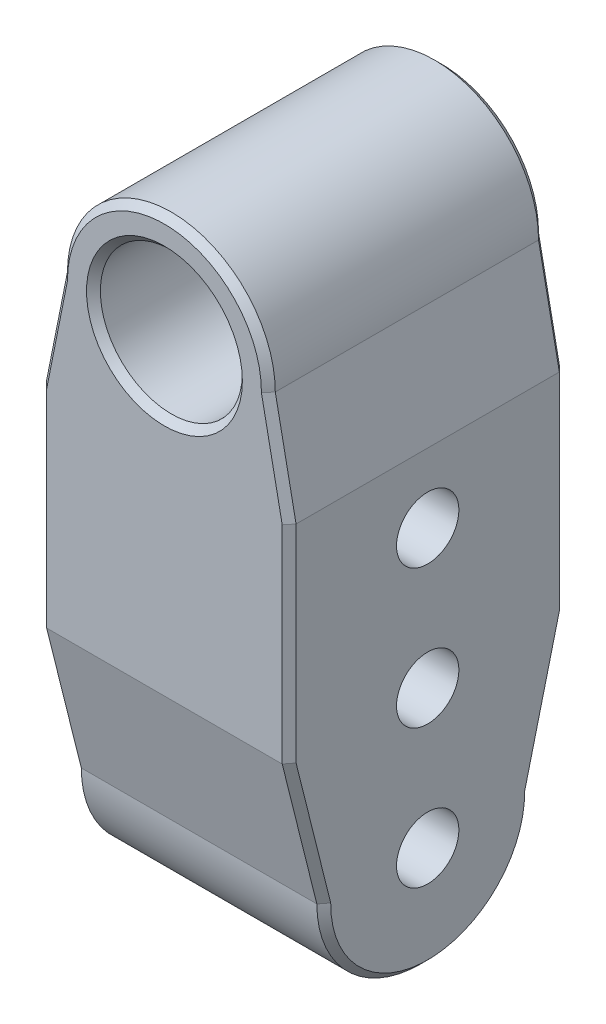
ISO-10303-21;
HEADER;
FILE_DESCRIPTION(('STEP AP214'),'2;1');
FILE_NAME('part.step','',(''),(''),'','','');
FILE_SCHEMA(('AUTOMOTIVE_DESIGN { 1 0 10303 214 1 1 1 1 }'));
ENDSEC;
DATA;
#1=APPLICATION_CONTEXT('core data for automotive mechanical design processes');
#2=APPLICATION_PROTOCOL_DEFINITION('international standard','automotive_design',2000,#1);
#3=PRODUCT_CONTEXT('',#1,'mechanical');
#4=PRODUCT('Part','Part','',(#3));
#5=PRODUCT_RELATED_PRODUCT_CATEGORY('part','',(#4));
#6=PRODUCT_DEFINITION_FORMATION('','',#4);
#7=PRODUCT_DEFINITION_CONTEXT('part definition',#1,'design');
#8=PRODUCT_DEFINITION('design','',#6,#7);
#9=PRODUCT_DEFINITION_SHAPE('','',#8);
#10=(LENGTH_UNIT() NAMED_UNIT(*) SI_UNIT(.MILLI.,.METRE.));
#11=(NAMED_UNIT(*) PLANE_ANGLE_UNIT() SI_UNIT($,.RADIAN.));
#12=(NAMED_UNIT(*) SI_UNIT($,.STERADIAN.) SOLID_ANGLE_UNIT());
#13=UNCERTAINTY_MEASURE_WITH_UNIT(LENGTH_MEASURE(1.E-05),#10,'distance_accuracy_value','');
#14=(GEOMETRIC_REPRESENTATION_CONTEXT(3) GLOBAL_UNCERTAINTY_ASSIGNED_CONTEXT((#13)) GLOBAL_UNIT_ASSIGNED_CONTEXT((#10,
#11,#12)) REPRESENTATION_CONTEXT('',''));
#15=CARTESIAN_POINT('',(0.,0.,0.));
#16=DIRECTION('',(0.,0.,1.));
#17=DIRECTION('',(1.,0.,0.));
#18=AXIS2_PLACEMENT_3D('',#15,#16,#17);
#19=CARTESIAN_POINT('',(18.,-80.,20.));
#20=DIRECTION('',(-1.,0.,0.));
#21=DIRECTION('',(0.,-1.,0.));
#22=AXIS2_PLACEMENT_3D('',#19,#20,#21);
#23=PLANE('',#22);
#24=CARTESIAN_POINT('',(18.,-25.,0.));
#25=DIRECTION('',(-1.,0.,0.));
#26=DIRECTION('',(0.,-1.,0.));
#27=AXIS2_PLACEMENT_3D('',#24,#25,#26);
#28=CIRCLE('',#27,4.5);
#29=CARTESIAN_POINT('',(18.,-29.5,0.));
#30=VERTEX_POINT('',#29);
#31=EDGE_CURVE('E394',#30,#30,#28,.T.);
#32=ORIENTED_EDGE('',*,*,#31,.T.);
#33=EDGE_LOOP('',(#32));
#34=FACE_BOUND('',#33,.T.);
#35=CARTESIAN_POINT('',(18.,-45.,0.));
#36=DIRECTION('',(-1.,0.,0.));
#37=DIRECTION('',(0.,-1.,0.));
#38=AXIS2_PLACEMENT_3D('',#35,#36,#37);
#39=CIRCLE('',#38,4.5);
#40=CARTESIAN_POINT('',(18.,-49.5,0.));
#41=VERTEX_POINT('',#40);
#42=EDGE_CURVE('E391',#41,#41,#39,.T.);
#43=ORIENTED_EDGE('',*,*,#42,.T.);
#44=EDGE_LOOP('',(#43));
#45=FACE_BOUND('',#44,.T.);
#46=CARTESIAN_POINT('',(18.,-65.,0.));
#47=DIRECTION('',(-1.,0.,0.));
#48=DIRECTION('',(0.,-1.,0.));
#49=AXIS2_PLACEMENT_3D('',#46,#47,#48);
#50=CIRCLE('',#49,4.5);
#51=CARTESIAN_POINT('',(18.,-69.5,0.));
#52=VERTEX_POINT('',#51);
#53=EDGE_CURVE('E386',#52,#52,#50,.T.);
#54=ORIENTED_EDGE('',*,*,#53,.T.);
#55=EDGE_LOOP('',(#54));
#56=FACE_BOUND('',#55,.T.);
#57=DIRECTION('',(0.,0.970142500145332,-0.242535625036333));
#58=VECTOR('',#57,1.);
#59=CARTESIAN_POINT('',(18.,-44.7574643749637,-19.0298574998547));
#60=LINE('',#59,#58);
#61=CARTESIAN_POINT('',(18.,-64.8789864532462,-13.999476980284));
#62=VERTEX_POINT('',#61);
#63=CARTESIAN_POINT('',(18.,-44.8768943743823,-19.));
#64=VERTEX_POINT('',#63);
#65=EDGE_CURVE('E50',#62,#64,#60,.T.);
#66=ORIENTED_EDGE('',*,*,#65,.T.);
#67=DIRECTION('',(0.,1.,0.));
#68=VECTOR('',#67,1.);
#69=CARTESIAN_POINT('',(18.,-80.,-19.));
#70=LINE('',#69,#68);
#71=CARTESIAN_POINT('',(18.,-15.,-19.));
#72=VERTEX_POINT('',#71);
#73=EDGE_CURVE('E11',#64,#72,#70,.T.);
#74=ORIENTED_EDGE('',*,*,#73,.T.);
#75=DIRECTION('',(0.,0.,-1.));
#76=VECTOR('',#75,1.);
#77=CARTESIAN_POINT('',(18.,-15.,20.));
#78=LINE('',#77,#76);
#79=CARTESIAN_POINT('',(18.,-15.,19.));
#80=VERTEX_POINT('',#79);
#81=EDGE_CURVE('E163',#80,#72,#78,.T.);
#82=ORIENTED_EDGE('',*,*,#81,.F.);
#83=DIRECTION('',(0.,-1.,0.));
#84=VECTOR('',#83,1.);
#85=CARTESIAN_POINT('',(18.,-45.,19.));
#86=LINE('',#85,#84);
#87=CARTESIAN_POINT('',(18.,-44.8768943743823,19.));
#88=VERTEX_POINT('',#87);
#89=EDGE_CURVE('E201',#80,#88,#86,.T.);
#90=ORIENTED_EDGE('',*,*,#89,.T.);
#91=DIRECTION('',(0.,-0.970142500145332,-0.242535625036333));
#92=VECTOR('',#91,1.);
#93=CARTESIAN_POINT('',(18.,-64.7574643749637,14.0298574998547));
#94=LINE('',#93,#92);
#95=CARTESIAN_POINT('',(18.,-64.8789864532462,13.9994769802841));
#96=VERTEX_POINT('',#95);
#97=EDGE_CURVE('E203',#88,#96,#94,.T.);
#98=ORIENTED_EDGE('',*,*,#97,.T.);
#99=CARTESIAN_POINT('',(18.,-65.,0.));
#100=DIRECTION('',(-1.,0.,0.));
#101=DIRECTION('',(0.,-1.,0.));
#102=AXIS2_PLACEMENT_3D('',#99,#100,#101);
#103=CIRCLE('',#102,14.);
#104=EDGE_CURVE('E61',#96,#62,#103,.F.);
#105=ORIENTED_EDGE('',*,*,#104,.T.);
#106=EDGE_LOOP('',(#66,#74,#82,#90,#98,#105));
#107=FACE_BOUND('',#106,.T.);
#108=ADVANCED_FACE('F40',(#34,#45,#56,#107),#23,.F.);
#109=CARTESIAN_POINT('',(-18.,-80.,20.));
#110=DIRECTION('',(1.,0.,0.));
#111=DIRECTION('',(0.,1.,0.));
#112=AXIS2_PLACEMENT_3D('',#109,#110,#111);
#113=PLANE('',#112);
#114=CARTESIAN_POINT('',(-18.,-25.,0.));
#115=DIRECTION('',(1.,0.,0.));
#116=DIRECTION('',(0.,1.,0.));
#117=AXIS2_PLACEMENT_3D('',#114,#115,#116);
#118=CIRCLE('',#117,4.5);
#119=CARTESIAN_POINT('',(-18.,-20.5,0.));
#120=VERTEX_POINT('',#119);
#121=EDGE_CURVE('E392',#120,#120,#118,.T.);
#122=ORIENTED_EDGE('',*,*,#121,.T.);
#123=EDGE_LOOP('',(#122));
#124=FACE_BOUND('',#123,.T.);
#125=CARTESIAN_POINT('',(-18.,-45.,0.));
#126=DIRECTION('',(1.,0.,0.));
#127=DIRECTION('',(0.,1.,0.));
#128=AXIS2_PLACEMENT_3D('',#125,#126,#127);
#129=CIRCLE('',#128,4.5);
#130=CARTESIAN_POINT('',(-18.,-40.5,0.));
#131=VERTEX_POINT('',#130);
#132=EDGE_CURVE('E388',#131,#131,#129,.T.);
#133=ORIENTED_EDGE('',*,*,#132,.T.);
#134=EDGE_LOOP('',(#133));
#135=FACE_BOUND('',#134,.T.);
#136=CARTESIAN_POINT('',(-18.,-65.,0.));
#137=DIRECTION('',(1.,0.,0.));
#138=DIRECTION('',(0.,1.,0.));
#139=AXIS2_PLACEMENT_3D('',#136,#137,#138);
#140=CIRCLE('',#139,4.5);
#141=CARTESIAN_POINT('',(-18.,-60.5,0.));
#142=VERTEX_POINT('',#141);
#143=EDGE_CURVE('E383',#142,#142,#140,.T.);
#144=ORIENTED_EDGE('',*,*,#143,.T.);
#145=EDGE_LOOP('',(#144));
#146=FACE_BOUND('',#145,.T.);
#147=DIRECTION('',(0.,0.970142500145332,0.242535625036333));
#148=VECTOR('',#147,1.);
#149=CARTESIAN_POINT('',(-18.,-44.7574643749637,19.0298574998547));
#150=LINE('',#149,#148);
#151=CARTESIAN_POINT('',(-18.,-64.8789864532462,13.999476980284));
#152=VERTEX_POINT('',#151);
#153=CARTESIAN_POINT('',(-18.,-44.8768943743823,19.));
#154=VERTEX_POINT('',#153);
#155=EDGE_CURVE('E437',#152,#154,#150,.T.);
#156=ORIENTED_EDGE('',*,*,#155,.T.);
#157=DIRECTION('',(0.,1.,0.));
#158=VECTOR('',#157,1.);
#159=CARTESIAN_POINT('',(-18.,-15.,19.));
#160=LINE('',#159,#158);
#161=CARTESIAN_POINT('',(-18.,-15.,19.));
#162=VERTEX_POINT('',#161);
#163=EDGE_CURVE('E439',#154,#162,#160,.T.);
#164=ORIENTED_EDGE('',*,*,#163,.T.);
#165=DIRECTION('',(0.,0.,-1.));
#166=VECTOR('',#165,1.);
#167=CARTESIAN_POINT('',(-18.,-15.,20.));
#168=LINE('',#167,#166);
#169=CARTESIAN_POINT('',(-18.,-15.,-19.));
#170=VERTEX_POINT('',#169);
#171=EDGE_CURVE('E379',#162,#170,#168,.T.);
#172=ORIENTED_EDGE('',*,*,#171,.T.);
#173=DIRECTION('',(0.,-1.,0.));
#174=VECTOR('',#173,1.);
#175=CARTESIAN_POINT('',(-18.,-80.,-19.));
#176=LINE('',#175,#174);
#177=CARTESIAN_POINT('',(-18.,-44.8768943743824,-19.));
#178=VERTEX_POINT('',#177);
#179=EDGE_CURVE('E431',#170,#178,#176,.T.);
#180=ORIENTED_EDGE('',*,*,#179,.T.);
#181=DIRECTION('',(0.,-0.970142500145332,0.242535625036333));
#182=VECTOR('',#181,1.);
#183=CARTESIAN_POINT('',(-18.,-64.7574643749637,-14.0298574998547));
#184=LINE('',#183,#182);
#185=CARTESIAN_POINT('',(-18.,-64.8789864532462,-13.999476980284));
#186=VERTEX_POINT('',#185);
#187=EDGE_CURVE('E433',#178,#186,#184,.T.);
#188=ORIENTED_EDGE('',*,*,#187,.T.);
#189=CARTESIAN_POINT('',(-18.,-65.,0.));
#190=DIRECTION('',(1.,0.,0.));
#191=DIRECTION('',(0.,1.,0.));
#192=AXIS2_PLACEMENT_3D('',#189,#190,#191);
#193=CIRCLE('',#192,14.);
#194=EDGE_CURVE('E435',#186,#152,#193,.F.);
#195=ORIENTED_EDGE('',*,*,#194,.T.);
#196=EDGE_LOOP('',(#156,#164,#172,#180,#188,#195));
#197=FACE_BOUND('',#196,.T.);
#198=ADVANCED_FACE('F483',(#124,#135,#146,#197),#113,.F.);
#199=CARTESIAN_POINT('',(0.,0.,20.));
#200=DIRECTION('',(0.,0.,1.));
#201=DIRECTION('',(1.,0.,0.));
#202=AXIS2_PLACEMENT_3D('',#199,#200,#201);
#203=PLANE('',#202);
#204=CARTESIAN_POINT('',(0.,0.,20.));
#205=DIRECTION('',(0.,0.,1.));
#206=DIRECTION('',(1.,0.,0.));
#207=AXIS2_PLACEMENT_3D('',#204,#205,#206);
#208=CIRCLE('',#207,11.25);
#209=CARTESIAN_POINT('',(11.25,0.,20.));
#210=VERTEX_POINT('',#209);
#211=EDGE_CURVE('E423',#210,#210,#208,.F.);
#212=ORIENTED_EDGE('',*,*,#211,.T.);
#213=EDGE_LOOP('',(#212));
#214=FACE_BOUND('',#213,.T.);
#215=DIRECTION('',(-0.196116135138184,-0.98058067569092,0.));
#216=VECTOR('',#215,1.);
#217=CARTESIAN_POINT('',(-17.0194193243091,-15.1961161351382,20.));
#218=LINE('',#217,#216);
#219=CARTESIAN_POINT('',(-13.9996616842377,-0.0973279347809829,20.));
#220=VERTEX_POINT('',#219);
#221=CARTESIAN_POINT('',(-17.,-15.0990195135928,20.));
#222=VERTEX_POINT('',#221);
#223=EDGE_CURVE('E418',#220,#222,#218,.T.);
#224=ORIENTED_EDGE('',*,*,#223,.T.);
#225=DIRECTION('',(0.,-1.,0.));
#226=VECTOR('',#225,1.);
#227=CARTESIAN_POINT('',(-17.,-45.,20.));
#228=LINE('',#227,#226);
#229=CARTESIAN_POINT('',(-17.,-45.,20.));
#230=VERTEX_POINT('',#229);
#231=EDGE_CURVE('E421',#222,#230,#228,.T.);
#232=ORIENTED_EDGE('',*,*,#231,.T.);
#233=DIRECTION('',(-1.,0.,0.));
#234=VECTOR('',#233,1.);
#235=CARTESIAN_POINT('',(154.479165076579,-45.,20.));
#236=LINE('',#235,#234);
#237=CARTESIAN_POINT('',(17.,-45.,20.));
#238=VERTEX_POINT('',#237);
#239=EDGE_CURVE('E387',#238,#230,#236,.T.);
#240=ORIENTED_EDGE('',*,*,#239,.F.);
#241=DIRECTION('',(0.,1.,0.));
#242=VECTOR('',#241,1.);
#243=CARTESIAN_POINT('',(17.,-15.,20.));
#244=LINE('',#243,#242);
#245=CARTESIAN_POINT('',(17.,-15.0990195135928,20.));
#246=VERTEX_POINT('',#245);
#247=EDGE_CURVE('E416',#238,#246,#244,.T.);
#248=ORIENTED_EDGE('',*,*,#247,.T.);
#249=DIRECTION('',(-0.196116135138184,0.98058067569092,0.));
#250=VECTOR('',#249,1.);
#251=CARTESIAN_POINT('',(14.0194193243091,-0.196116135138179,20.));
#252=LINE('',#251,#250);
#253=CARTESIAN_POINT('',(13.9996616842377,-0.09732793478099,20.));
#254=VERTEX_POINT('',#253);
#255=EDGE_CURVE('E414',#246,#254,#252,.T.);
#256=ORIENTED_EDGE('',*,*,#255,.T.);
#257=CARTESIAN_POINT('',(0.,0.,20.));
#258=DIRECTION('',(0.,0.,1.));
#259=DIRECTION('',(1.,0.,0.));
#260=AXIS2_PLACEMENT_3D('',#257,#258,#259);
#261=CIRCLE('',#260,14.);
#262=EDGE_CURVE('E412',#254,#220,#261,.T.);
#263=ORIENTED_EDGE('',*,*,#262,.T.);
#264=EDGE_LOOP('',(#224,#232,#240,#248,#256,#263));
#265=FACE_BOUND('',#264,.T.);
#266=ADVANCED_FACE('F468',(#214,#265),#203,.T.);
#267=CARTESIAN_POINT('',(0.,0.,-20.));
#268=DIRECTION('',(0.,0.,1.));
#269=DIRECTION('',(1.,0.,0.));
#270=AXIS2_PLACEMENT_3D('',#267,#268,#269);
#271=PLANE('',#270);
#272=CARTESIAN_POINT('',(0.,0.,-20.));
#273=DIRECTION('',(0.,0.,1.));
#274=DIRECTION('',(1.,0.,0.));
#275=AXIS2_PLACEMENT_3D('',#272,#273,#274);
#276=CIRCLE('',#275,11.25);
#277=CARTESIAN_POINT('',(11.25,0.,-20.));
#278=VERTEX_POINT('',#277);
#279=EDGE_CURVE('E403',#278,#278,#276,.T.);
#280=ORIENTED_EDGE('',*,*,#279,.T.);
#281=EDGE_LOOP('',(#280));
#282=FACE_BOUND('',#281,.T.);
#283=DIRECTION('',(-1.,0.,0.));
#284=VECTOR('',#283,1.);
#285=CARTESIAN_POINT('',(154.479165076579,-45.,-20.));
#286=LINE('',#285,#284);
#287=CARTESIAN_POINT('',(17.,-45.,-20.));
#288=VERTEX_POINT('',#287);
#289=CARTESIAN_POINT('',(-17.,-45.,-20.));
#290=VERTEX_POINT('',#289);
#291=EDGE_CURVE('E155',#288,#290,#286,.T.);
#292=ORIENTED_EDGE('',*,*,#291,.T.);
#293=DIRECTION('',(0.,1.,0.));
#294=VECTOR('',#293,1.);
#295=CARTESIAN_POINT('',(-17.,0.,-20.));
#296=LINE('',#295,#294);
#297=CARTESIAN_POINT('',(-17.,-15.0990195135928,-20.));
#298=VERTEX_POINT('',#297);
#299=EDGE_CURVE('E401',#290,#298,#296,.T.);
#300=ORIENTED_EDGE('',*,*,#299,.T.);
#301=DIRECTION('',(0.196116135138184,0.98058067569092,0.));
#302=VECTOR('',#301,1.);
#303=CARTESIAN_POINT('',(-13.442496247386,2.6884992494772,-20.));
#304=LINE('',#303,#302);
#305=CARTESIAN_POINT('',(-13.9996616842377,-0.0973279347810245,-20.));
#306=VERTEX_POINT('',#305);
#307=EDGE_CURVE('E399',#298,#306,#304,.T.);
#308=ORIENTED_EDGE('',*,*,#307,.T.);
#309=CARTESIAN_POINT('',(0.,0.,-20.));
#310=DIRECTION('',(0.,0.,1.));
#311=DIRECTION('',(1.,0.,0.));
#312=AXIS2_PLACEMENT_3D('',#309,#310,#311);
#313=CIRCLE('',#312,14.);
#314=CARTESIAN_POINT('',(13.9996616842377,-0.0973279347810152,-20.));
#315=VERTEX_POINT('',#314);
#316=EDGE_CURVE('E397',#306,#315,#313,.F.);
#317=ORIENTED_EDGE('',*,*,#316,.T.);
#318=DIRECTION('',(0.196116135138184,-0.98058067569092,0.));
#319=VECTOR('',#318,1.);
#320=CARTESIAN_POINT('',(13.442496247386,2.6884992494772,-20.));
#321=LINE('',#320,#319);
#322=CARTESIAN_POINT('',(17.,-15.0990195135928,-20.));
#323=VERTEX_POINT('',#322);
#324=EDGE_CURVE('E158',#315,#323,#321,.T.);
#325=ORIENTED_EDGE('',*,*,#324,.T.);
#326=DIRECTION('',(0.,-1.,0.));
#327=VECTOR('',#326,1.);
#328=CARTESIAN_POINT('',(17.,0.,-20.));
#329=LINE('',#328,#327);
#330=EDGE_CURVE('E152',#323,#288,#329,.T.);
#331=ORIENTED_EDGE('',*,*,#330,.T.);
#332=EDGE_LOOP('',(#292,#300,#308,#317,#325,#331));
#333=FACE_BOUND('',#332,.T.);
#334=ADVANCED_FACE('F154',(#282,#333),#271,.F.);
#335=CARTESIAN_POINT('',(18.,-15.,20.));
#336=DIRECTION('',(-0.98058067569092,-0.196116135138184,0.));
#337=DIRECTION('',(0.196116135138184,-0.98058067569092,0.));
#338=AXIS2_PLACEMENT_3D('',#335,#336,#337);
#339=PLANE('',#338);
#340=ORIENTED_EDGE('',*,*,#81,.T.);
#341=DIRECTION('',(-0.196116135138184,0.98058067569092,0.));
#342=VECTOR('',#341,1.);
#343=CARTESIAN_POINT('',(18.,-15.,-19.));
#344=LINE('',#343,#342);
#345=CARTESIAN_POINT('',(15.,0.,-19.));
#346=VERTEX_POINT('',#345);
#347=EDGE_CURVE('E199',#72,#346,#344,.T.);
#348=ORIENTED_EDGE('',*,*,#347,.T.);
#349=DIRECTION('',(0.,0.,-1.));
#350=VECTOR('',#349,1.);
#351=CARTESIAN_POINT('',(15.,0.,20.));
#352=LINE('',#351,#350);
#353=CARTESIAN_POINT('',(15.,0.,19.));
#354=VERTEX_POINT('',#353);
#355=EDGE_CURVE('E368',#354,#346,#352,.T.);
#356=ORIENTED_EDGE('',*,*,#355,.F.);
#357=DIRECTION('',(0.196116135138184,-0.98058067569092,0.));
#358=VECTOR('',#357,1.);
#359=CARTESIAN_POINT('',(18.,-15.,19.));
#360=LINE('',#359,#358);
#361=EDGE_CURVE('E197',#354,#80,#360,.T.);
#362=ORIENTED_EDGE('',*,*,#361,.T.);
#363=EDGE_LOOP('',(#340,#348,#356,#362));
#364=FACE_BOUND('',#363,.T.);
#365=ADVANCED_FACE('F367',(#364),#339,.F.);
#366=CARTESIAN_POINT('',(0.,0.,20.));
#367=DIRECTION('',(0.,0.,-1.));
#368=DIRECTION('',(-1.,0.,0.));
#369=AXIS2_PLACEMENT_3D('',#366,#367,#368);
#370=CYLINDRICAL_SURFACE('',#369,15.);
#371=ORIENTED_EDGE('',*,*,#355,.T.);
#372=CARTESIAN_POINT('',(0.,0.,-19.));
#373=DIRECTION('',(0.,0.,1.));
#374=DIRECTION('',(1.,0.,0.));
#375=AXIS2_PLACEMENT_3D('',#372,#373,#374);
#376=CIRCLE('',#375,15.);
#377=CARTESIAN_POINT('',(-15.,0.,-19.));
#378=VERTEX_POINT('',#377);
#379=EDGE_CURVE('E195',#346,#378,#376,.T.);
#380=ORIENTED_EDGE('',*,*,#379,.T.);
#381=DIRECTION('',(0.,0.,-1.));
#382=VECTOR('',#381,1.);
#383=CARTESIAN_POINT('',(-15.,0.,20.));
#384=LINE('',#383,#382);
#385=CARTESIAN_POINT('',(-15.,0.,19.));
#386=VERTEX_POINT('',#385);
#387=EDGE_CURVE('E376',#386,#378,#384,.T.);
#388=ORIENTED_EDGE('',*,*,#387,.F.);
#389=CARTESIAN_POINT('',(0.,0.,19.));
#390=DIRECTION('',(0.,0.,1.));
#391=DIRECTION('',(1.,0.,0.));
#392=AXIS2_PLACEMENT_3D('',#389,#390,#391);
#393=CIRCLE('',#392,15.);
#394=EDGE_CURVE('E188',#386,#354,#393,.F.);
#395=ORIENTED_EDGE('',*,*,#394,.T.);
#396=EDGE_LOOP('',(#371,#380,#388,#395));
#397=FACE_BOUND('',#396,.T.);
#398=ADVANCED_FACE('F372',(#397),#370,.T.);
#399=CARTESIAN_POINT('',(-18.,-15.,20.));
#400=DIRECTION('',(0.98058067569092,-0.196116135138184,0.));
#401=DIRECTION('',(0.196116135138184,0.98058067569092,0.));
#402=AXIS2_PLACEMENT_3D('',#399,#400,#401);
#403=PLANE('',#402);
#404=ORIENTED_EDGE('',*,*,#171,.F.);
#405=DIRECTION('',(0.196116135138184,0.98058067569092,0.));
#406=VECTOR('',#405,1.);
#407=CARTESIAN_POINT('',(-15.,0.,19.));
#408=LINE('',#407,#406);
#409=EDGE_CURVE('E428',#162,#386,#408,.T.);
#410=ORIENTED_EDGE('',*,*,#409,.T.);
#411=ORIENTED_EDGE('',*,*,#387,.T.);
#412=DIRECTION('',(-0.196116135138184,-0.98058067569092,0.));
#413=VECTOR('',#412,1.);
#414=CARTESIAN_POINT('',(-18.,-15.,-19.));
#415=LINE('',#414,#413);
#416=EDGE_CURVE('E426',#378,#170,#415,.T.);
#417=ORIENTED_EDGE('',*,*,#416,.T.);
#418=EDGE_LOOP('',(#404,#410,#411,#417));
#419=FACE_BOUND('',#418,.T.);
#420=ADVANCED_FACE('F507',(#419),#403,.F.);
#421=CARTESIAN_POINT('',(0.,0.,20.));
#422=DIRECTION('',(0.,0.,-1.));
#423=DIRECTION('',(-1.,0.,0.));
#424=AXIS2_PLACEMENT_3D('',#421,#422,#423);
#425=CYLINDRICAL_SURFACE('',#424,10.25);
#426=CARTESIAN_POINT('',(0.,0.,-19.));
#427=DIRECTION('',(0.,0.,1.));
#428=DIRECTION('',(1.,0.,0.));
#429=AXIS2_PLACEMENT_3D('',#426,#427,#428);
#430=CIRCLE('',#429,10.25);
#431=CARTESIAN_POINT('',(10.25,0.,-19.));
#432=VERTEX_POINT('',#431);
#433=EDGE_CURVE('E409',#432,#432,#430,.F.);
#434=ORIENTED_EDGE('',*,*,#433,.T.);
#435=EDGE_LOOP('',(#434));
#436=FACE_BOUND('',#435,.T.);
#437=CARTESIAN_POINT('',(0.,0.,19.));
#438=DIRECTION('',(0.,0.,1.));
#439=DIRECTION('',(1.,0.,0.));
#440=AXIS2_PLACEMENT_3D('',#437,#438,#439);
#441=CIRCLE('',#440,10.25);
#442=CARTESIAN_POINT('',(10.25,0.,19.));
#443=VERTEX_POINT('',#442);
#444=EDGE_CURVE('E406',#443,#443,#441,.T.);
#445=ORIENTED_EDGE('',*,*,#444,.T.);
#446=EDGE_LOOP('',(#445));
#447=FACE_BOUND('',#446,.T.);
#448=ADVANCED_FACE('F510',(#436,#447),#425,.F.);
#449=CARTESIAN_POINT('',(-20.,-65.,0.));
#450=DIRECTION('',(1.,0.,0.));
#451=DIRECTION('',(0.,0.,-1.));
#452=AXIS2_PLACEMENT_3D('',#449,#450,#451);
#453=CYLINDRICAL_SURFACE('',#452,4.5);
#454=ORIENTED_EDGE('',*,*,#143,.F.);
#455=EDGE_LOOP('',(#454));
#456=FACE_BOUND('',#455,.T.);
#457=ORIENTED_EDGE('',*,*,#53,.F.);
#458=EDGE_LOOP('',(#457));
#459=FACE_BOUND('',#458,.T.);
#460=ADVANCED_FACE('F516',(#456,#459),#453,.F.);
#461=CARTESIAN_POINT('',(-20.,-45.,0.));
#462=DIRECTION('',(1.,0.,0.));
#463=DIRECTION('',(0.,0.,-1.));
#464=AXIS2_PLACEMENT_3D('',#461,#462,#463);
#465=CYLINDRICAL_SURFACE('',#464,4.5);
#466=ORIENTED_EDGE('',*,*,#132,.F.);
#467=EDGE_LOOP('',(#466));
#468=FACE_BOUND('',#467,.T.);
#469=ORIENTED_EDGE('',*,*,#42,.F.);
#470=EDGE_LOOP('',(#469));
#471=FACE_BOUND('',#470,.T.);
#472=ADVANCED_FACE('F561',(#468,#471),#465,.F.);
#473=CARTESIAN_POINT('',(-20.,-25.,0.));
#474=DIRECTION('',(1.,0.,0.));
#475=DIRECTION('',(0.,0.,-1.));
#476=AXIS2_PLACEMENT_3D('',#473,#474,#475);
#477=CYLINDRICAL_SURFACE('',#476,4.5);
#478=ORIENTED_EDGE('',*,*,#121,.F.);
#479=EDGE_LOOP('',(#478));
#480=FACE_BOUND('',#479,.T.);
#481=ORIENTED_EDGE('',*,*,#31,.F.);
#482=EDGE_LOOP('',(#481));
#483=FACE_BOUND('',#482,.T.);
#484=ADVANCED_FACE('F565',(#480,#483),#477,.F.);
#485=CARTESIAN_POINT('',(154.479165076579,-45.,20.));
#486=DIRECTION('',(0.,-0.242535625036333,0.970142500145332));
#487=DIRECTION('',(0.,-0.970142500145332,-0.242535625036333));
#488=AXIS2_PLACEMENT_3D('',#485,#486,#487);
#489=PLANE('',#488);
#490=ORIENTED_EDGE('',*,*,#239,.T.);
#491=DIRECTION('',(0.,-0.970142500145332,-0.242535625036333));
#492=VECTOR('',#491,1.);
#493=CARTESIAN_POINT('',(-17.,-65.,15.));
#494=LINE('',#493,#492);
#495=CARTESIAN_POINT('',(-17.,-65.,15.));
#496=VERTEX_POINT('',#495);
#497=EDGE_CURVE('E443',#230,#496,#494,.T.);
#498=ORIENTED_EDGE('',*,*,#497,.T.);
#499=DIRECTION('',(-1.,0.,0.));
#500=VECTOR('',#499,1.);
#501=CARTESIAN_POINT('',(154.479165076579,-65.,15.));
#502=LINE('',#501,#500);
#503=CARTESIAN_POINT('',(17.,-65.,15.));
#504=VERTEX_POINT('',#503);
#505=EDGE_CURVE('E448',#504,#496,#502,.T.);
#506=ORIENTED_EDGE('',*,*,#505,.F.);
#507=DIRECTION('',(0.,0.970142500145332,0.242535625036333));
#508=VECTOR('',#507,1.);
#509=CARTESIAN_POINT('',(17.,-45.,20.));
#510=LINE('',#509,#508);
#511=EDGE_CURVE('E441',#504,#238,#510,.T.);
#512=ORIENTED_EDGE('',*,*,#511,.T.);
#513=EDGE_LOOP('',(#490,#498,#506,#512));
#514=FACE_BOUND('',#513,.T.);
#515=ADVANCED_FACE('F454',(#514),#489,.T.);
#516=CARTESIAN_POINT('',(154.479165076579,-65.,0.));
#517=DIRECTION('',(-1.,0.,0.));
#518=DIRECTION('',(0.,-1.,0.));
#519=AXIS2_PLACEMENT_3D('',#516,#517,#518);
#520=CYLINDRICAL_SURFACE('',#519,15.);
#521=ORIENTED_EDGE('',*,*,#505,.T.);
#522=CARTESIAN_POINT('',(-17.,-65.,0.));
#523=DIRECTION('',(1.,0.,0.));
#524=DIRECTION('',(0.,0.,-1.));
#525=AXIS2_PLACEMENT_3D('',#522,#523,#524);
#526=CIRCLE('',#525,15.);
#527=CARTESIAN_POINT('',(-17.,-65.,-15.));
#528=VERTEX_POINT('',#527);
#529=EDGE_CURVE('E186',#496,#528,#526,.T.);
#530=ORIENTED_EDGE('',*,*,#529,.T.);
#531=DIRECTION('',(-1.,0.,0.));
#532=VECTOR('',#531,1.);
#533=CARTESIAN_POINT('',(154.479165076579,-65.,-15.));
#534=LINE('',#533,#532);
#535=CARTESIAN_POINT('',(17.,-65.,-15.));
#536=VERTEX_POINT('',#535);
#537=EDGE_CURVE('E173',#536,#528,#534,.T.);
#538=ORIENTED_EDGE('',*,*,#537,.F.);
#539=CARTESIAN_POINT('',(17.,-65.,0.));
#540=DIRECTION('',(-1.,0.,0.));
#541=DIRECTION('',(0.,0.,1.));
#542=AXIS2_PLACEMENT_3D('',#539,#540,#541);
#543=CIRCLE('',#542,15.);
#544=EDGE_CURVE('E190',#536,#504,#543,.T.);
#545=ORIENTED_EDGE('',*,*,#544,.T.);
#546=EDGE_LOOP('',(#521,#530,#538,#545));
#547=FACE_BOUND('',#546,.T.);
#548=ADVANCED_FACE('F447',(#547),#520,.T.);
#549=CARTESIAN_POINT('',(154.479165076579,-45.,-20.));
#550=DIRECTION('',(0.,-0.242535625036333,-0.970142500145332));
#551=DIRECTION('',(0.,0.970142500145332,-0.242535625036333));
#552=AXIS2_PLACEMENT_3D('',#549,#550,#551);
#553=PLANE('',#552);
#554=ORIENTED_EDGE('',*,*,#537,.T.);
#555=DIRECTION('',(0.,0.970142500145332,-0.242535625036333));
#556=VECTOR('',#555,1.);
#557=CARTESIAN_POINT('',(-17.,-45.,-20.));
#558=LINE('',#557,#556);
#559=EDGE_CURVE('E172',#528,#290,#558,.T.);
#560=ORIENTED_EDGE('',*,*,#559,.T.);
#561=ORIENTED_EDGE('',*,*,#291,.F.);
#562=DIRECTION('',(0.,-0.970142500145332,0.242535625036333));
#563=VECTOR('',#562,1.);
#564=CARTESIAN_POINT('',(17.,-65.0000000000001,-15.));
#565=LINE('',#564,#563);
#566=EDGE_CURVE('E169',#288,#536,#565,.T.);
#567=ORIENTED_EDGE('',*,*,#566,.T.);
#568=EDGE_LOOP('',(#554,#560,#561,#567));
#569=FACE_BOUND('',#568,.T.);
#570=ADVANCED_FACE('F167',(#569),#553,.T.);
#571=CARTESIAN_POINT('',(0.,0.,-20.));
#572=DIRECTION('',(0.,0.,-1.));
#573=DIRECTION('',(-1.,0.,0.));
#574=AXIS2_PLACEMENT_3D('',#571,#572,#573);
#575=CONICAL_SURFACE('',#574,11.25,0.785398163397446);
#576=ORIENTED_EDGE('',*,*,#433,.F.);
#577=EDGE_LOOP('',(#576));
#578=FACE_BOUND('',#577,.T.);
#579=ORIENTED_EDGE('',*,*,#279,.F.);
#580=EDGE_LOOP('',(#579));
#581=FACE_BOUND('',#580,.T.);
#582=ADVANCED_FACE('F532',(#578,#581),#575,.F.);
#583=CARTESIAN_POINT('',(0.,0.,19.));
#584=DIRECTION('',(0.,0.,1.));
#585=DIRECTION('',(1.,0.,0.));
#586=AXIS2_PLACEMENT_3D('',#583,#584,#585);
#587=CONICAL_SURFACE('',#586,10.25,0.785398163397453);
#588=ORIENTED_EDGE('',*,*,#211,.F.);
#589=EDGE_LOOP('',(#588));
#590=FACE_BOUND('',#589,.T.);
#591=ORIENTED_EDGE('',*,*,#444,.F.);
#592=EDGE_LOOP('',(#591));
#593=FACE_BOUND('',#592,.T.);
#594=ADVANCED_FACE('F537',(#590,#593),#587,.F.);
#595=CARTESIAN_POINT('',(18.,-15.,-19.));
#596=DIRECTION('',(-0.693375245281536,-0.138675049056307,0.707106781186548));
#597=DIRECTION('',(-0.196116135138184,0.98058067569092,0.));
#598=AXIS2_PLACEMENT_3D('',#595,#596,#597);
#599=PLANE('',#598);
#600=CARTESIAN_POINT('',(13.9996616842377,-0.0973279347810167,-20.));
#601=CARTESIAN_POINT('',(14.1664274385752,-0.0813948588162202,-19.8333479906505));
#602=CARTESIAN_POINT('',(14.3331718431529,-0.0653176594935757,-19.6666886515471));
#603=CARTESIAN_POINT('',(14.6666179484059,-0.0328750145590098,-19.3333553182133));
#604=CARTESIAN_POINT('',(14.8333196490823,-0.0165095689546656,-19.1666813239835));
#605=CARTESIAN_POINT('',(15.,0.,-19.));
#606=B_SPLINE_CURVE_WITH_KNOTS('',3,(#600,#601,#602,#603,#604,#605),.UNSPECIFIED.,.F.,.F.,(4,2,
4),(0.,0.708898845363654,1.4177976720921),.UNSPECIFIED.);
#607=EDGE_CURVE('E178',#346,#315,#606,.F.);
#608=ORIENTED_EDGE('',*,*,#607,.F.);
#609=ORIENTED_EDGE('',*,*,#347,.F.);
#610=DIRECTION('',(0.705379856727684,0.0698463703113178,0.705379856727682));
#611=VECTOR('',#610,1.);
#612=CARTESIAN_POINT('',(14.7975655255955,-15.3171035039683,-22.2024344744045));
#613=LINE('',#612,#611);
#614=EDGE_CURVE('E45',#323,#72,#613,.T.);
#615=ORIENTED_EDGE('',*,*,#614,.F.);
#616=ORIENTED_EDGE('',*,*,#324,.F.);
#617=EDGE_LOOP('',(#608,#609,#615,#616));
#618=FACE_BOUND('',#617,.T.);
#619=ADVANCED_FACE('F350',(#618),#599,.F.);
#620=CARTESIAN_POINT('',(18.,-80.,-19.));
#621=DIRECTION('',(-0.707106781186546,0.,0.707106781186549));
#622=DIRECTION('',(0.,1.,0.));
#623=AXIS2_PLACEMENT_3D('',#620,#621,#622);
#624=PLANE('',#623);
#625=ORIENTED_EDGE('',*,*,#614,.T.);
#626=ORIENTED_EDGE('',*,*,#73,.F.);
#627=DIRECTION('',(-0.704442861104866,-0.0867208791282856,-0.704442861104864));
#628=VECTOR('',#627,1.);
#629=CARTESIAN_POINT('',(17.,-45.,-20.));
#630=LINE('',#629,#628);
#631=EDGE_CURVE('E176',#288,#64,#630,.F.);
#632=ORIENTED_EDGE('',*,*,#631,.F.);
#633=ORIENTED_EDGE('',*,*,#330,.F.);
#634=EDGE_LOOP('',(#625,#626,#632,#633));
#635=FACE_BOUND('',#634,.T.);
#636=ADVANCED_FACE('F43',(#635),#624,.F.);
#637=CARTESIAN_POINT('',(0.,0.,-19.));
#638=DIRECTION('',(0.,0.,1.));
#639=DIRECTION('',(1.,0.,0.));
#640=AXIS2_PLACEMENT_3D('',#637,#638,#639);
#641=CONICAL_SURFACE('',#640,15.,0.785398163397446);
#642=ORIENTED_EDGE('',*,*,#607,.T.);
#643=ORIENTED_EDGE('',*,*,#316,.F.);
#644=CARTESIAN_POINT('',(-13.9996616842377,-0.0973279347810245,-20.));
#645=CARTESIAN_POINT('',(-14.1664274385752,-0.0813948588162159,-19.8333479906505));
#646=CARTESIAN_POINT('',(-14.3331718431529,-0.0653176594935646,-19.6666886515471));
#647=CARTESIAN_POINT('',(-14.6666179484059,-0.0328750145589954,-19.3333553182133));
#648=CARTESIAN_POINT('',(-14.8333196490823,-0.0165095689546549,-19.1666813239835));
#649=CARTESIAN_POINT('',(-15.,0.,-19.));
#650=B_SPLINE_CURVE_WITH_KNOTS('',3,(#644,#645,#646,#647,#648,#649),.UNSPECIFIED.,.F.,.F.,(4,2,
4),(0.,0.708898845363653,1.41779767209209),.UNSPECIFIED.);
#651=EDGE_CURVE('E179',#378,#306,#650,.F.);
#652=ORIENTED_EDGE('',*,*,#651,.F.);
#653=ORIENTED_EDGE('',*,*,#379,.F.);
#654=EDGE_LOOP('',(#642,#643,#652,#653));
#655=FACE_BOUND('',#654,.T.);
#656=ADVANCED_FACE('F330',(#655),#641,.T.);
#657=CARTESIAN_POINT('',(17.,-45.,-20.));
#658=DIRECTION('',(0.707106781186556,-0.171498585142507,-0.685994340570027));
#659=DIRECTION('',(0.,0.970142500145332,-0.242535625036333));
#660=AXIS2_PLACEMENT_3D('',#657,#658,#659);
#661=PLANE('',#660);
#662=ORIENTED_EDGE('',*,*,#631,.T.);
#663=ORIENTED_EDGE('',*,*,#65,.F.);
#664=CARTESIAN_POINT('',(17.,-65.,-15.));
#665=CARTESIAN_POINT('',(17.1666893878494,-64.9794735650646,-14.8333121205408));
#666=CARTESIAN_POINT('',(17.333367413405,-64.9591258855697,-14.6665912642056));
#667=CARTESIAN_POINT('',(17.6667007467393,-64.9187880366372,-14.3330835909697));
#668=CARTESIAN_POINT('',(17.8333560545169,-64.8987978672141,-14.1662967740662));
#669=CARTESIAN_POINT('',(18.,-64.8789864532462,-13.9994769802841));
#670=B_SPLINE_CURVE_WITH_KNOTS('',3,(#664,#665,#666,#667,#668,#669),.UNSPECIFIED.,.F.,.F.,(4,2,
4),(0.,0.709875288913377,1.41975060683294),.UNSPECIFIED.);
#671=EDGE_CURVE('E184',#536,#62,#670,.T.);
#672=ORIENTED_EDGE('',*,*,#671,.F.);
#673=ORIENTED_EDGE('',*,*,#566,.F.);
#674=EDGE_LOOP('',(#662,#663,#672,#673));
#675=FACE_BOUND('',#674,.T.);
#676=ADVANCED_FACE('F182',(#675),#661,.T.);
#677=CARTESIAN_POINT('',(-18.,-15.,-19.));
#678=DIRECTION('',(0.693375245281536,-0.138675049056307,0.707106781186548));
#679=DIRECTION('',(-0.196116135138184,-0.98058067569092,0.));
#680=AXIS2_PLACEMENT_3D('',#677,#678,#679);
#681=PLANE('',#680);
#682=ORIENTED_EDGE('',*,*,#651,.T.);
#683=ORIENTED_EDGE('',*,*,#307,.F.);
#684=DIRECTION('',(-0.705379856727685,0.0698463703113133,0.705379856727682));
#685=VECTOR('',#684,1.);
#686=CARTESIAN_POINT('',(-18.,-15.,-19.));
#687=LINE('',#686,#685);
#688=EDGE_CURVE('E302',#170,#298,#687,.F.);
#689=ORIENTED_EDGE('',*,*,#688,.F.);
#690=ORIENTED_EDGE('',*,*,#416,.F.);
#691=EDGE_LOOP('',(#682,#683,#689,#690));
#692=FACE_BOUND('',#691,.T.);
#693=ADVANCED_FACE('F329',(#692),#681,.F.);
#694=CARTESIAN_POINT('',(17.,-65.,0.));
#695=DIRECTION('',(-1.,0.,0.));
#696=DIRECTION('',(0.,0.,1.));
#697=AXIS2_PLACEMENT_3D('',#694,#695,#696);
#698=CONICAL_SURFACE('',#697,15.,0.785398163397451);
#699=ORIENTED_EDGE('',*,*,#671,.T.);
#700=ORIENTED_EDGE('',*,*,#104,.F.);
#701=CARTESIAN_POINT('',(17.,-65.,15.));
#702=CARTESIAN_POINT('',(17.1666893878494,-64.9794735650646,14.8333121205408));
#703=CARTESIAN_POINT('',(17.333367413405,-64.9591258855697,14.6665912642056));
#704=CARTESIAN_POINT('',(17.6667007467393,-64.9187880366372,14.3330835909697));
#705=CARTESIAN_POINT('',(17.8333560545169,-64.8987978672141,14.1662967740662));
#706=CARTESIAN_POINT('',(18.,-64.8789864532462,13.999476980284));
#707=B_SPLINE_CURVE_WITH_KNOTS('',3,(#701,#702,#703,#704,#705,#706),.UNSPECIFIED.,.F.,.F.,(4,2,
4),(0.,0.709875288913381,1.41975060683295),.UNSPECIFIED.);
#708=EDGE_CURVE('E293',#504,#96,#707,.T.);
#709=ORIENTED_EDGE('',*,*,#708,.F.);
#710=ORIENTED_EDGE('',*,*,#544,.F.);
#711=EDGE_LOOP('',(#699,#700,#709,#710));
#712=FACE_BOUND('',#711,.T.);
#713=ADVANCED_FACE('F305',(#712),#698,.T.);
#714=CARTESIAN_POINT('',(-18.,-80.,-19.));
#715=DIRECTION('',(0.707106781186546,0.,0.707106781186549));
#716=DIRECTION('',(0.,-1.,0.));
#717=AXIS2_PLACEMENT_3D('',#714,#715,#716);
#718=PLANE('',#717);
#719=ORIENTED_EDGE('',*,*,#688,.T.);
#720=ORIENTED_EDGE('',*,*,#299,.F.);
#721=DIRECTION('',(0.704442861104871,-0.0867208791282258,-0.704442861104867));
#722=VECTOR('',#721,1.);
#723=CARTESIAN_POINT('',(-15.8543328417516,-45.1410380722658,-21.1456671582484));
#724=LINE('',#723,#722);
#725=EDGE_CURVE('E290',#178,#290,#724,.T.);
#726=ORIENTED_EDGE('',*,*,#725,.F.);
#727=ORIENTED_EDGE('',*,*,#179,.F.);
#728=EDGE_LOOP('',(#719,#720,#726,#727));
#729=FACE_BOUND('',#728,.T.);
#730=ADVANCED_FACE('F315',(#729),#718,.F.);
#731=CARTESIAN_POINT('',(17.,-45.,20.));
#732=DIRECTION('',(0.707106781186554,-0.171498585142507,0.685994340570029));
#733=DIRECTION('',(0.,-0.970142500145332,-0.242535625036333));
#734=AXIS2_PLACEMENT_3D('',#731,#732,#733);
#735=PLANE('',#734);
#736=ORIENTED_EDGE('',*,*,#708,.T.);
#737=ORIENTED_EDGE('',*,*,#97,.F.);
#738=DIRECTION('',(0.704442861104865,0.0867208791282338,-0.704442861104872));
#739=VECTOR('',#738,1.);
#740=CARTESIAN_POINT('',(19.749045689478,-44.6615770105452,17.250954310522));
#741=LINE('',#740,#739);
#742=EDGE_CURVE('E286',#238,#88,#741,.T.);
#743=ORIENTED_EDGE('',*,*,#742,.F.);
#744=ORIENTED_EDGE('',*,*,#511,.F.);
#745=EDGE_LOOP('',(#736,#737,#743,#744));
#746=FACE_BOUND('',#745,.T.);
#747=ADVANCED_FACE('F308',(#746),#735,.T.);
#748=CARTESIAN_POINT('',(-17.,-45.,-20.));
#749=DIRECTION('',(-0.707106781186548,-0.171498585142509,-0.685994340570035));
#750=DIRECTION('',(0.,-0.970142500145332,0.242535625036333));
#751=AXIS2_PLACEMENT_3D('',#748,#749,#750);
#752=PLANE('',#751);
#753=ORIENTED_EDGE('',*,*,#725,.T.);
#754=ORIENTED_EDGE('',*,*,#559,.F.);
#755=CARTESIAN_POINT('',(-17.,-65.,-15.));
#756=CARTESIAN_POINT('',(-17.1666893878493,-64.9794735650646,-14.8333121205408));
#757=CARTESIAN_POINT('',(-17.333367413405,-64.9591258855697,-14.6665912642056));
#758=CARTESIAN_POINT('',(-17.6667007467393,-64.9187880366372,-14.3330835909697));
#759=CARTESIAN_POINT('',(-17.8333560545169,-64.8987978672141,-14.1662967740662));
#760=CARTESIAN_POINT('',(-18.,-64.8789864532462,-13.999476980284));
#761=B_SPLINE_CURVE_WITH_KNOTS('',3,(#755,#756,#757,#758,#759,#760),.UNSPECIFIED.,.F.,.F.,(4,2,
4),(0.,0.709875288913388,1.41975060683296),.UNSPECIFIED.);
#762=EDGE_CURVE('E279',#186,#528,#761,.F.);
#763=ORIENTED_EDGE('',*,*,#762,.F.);
#764=ORIENTED_EDGE('',*,*,#187,.F.);
#765=EDGE_LOOP('',(#753,#754,#763,#764));
#766=FACE_BOUND('',#765,.T.);
#767=ADVANCED_FACE('F274',(#766),#752,.T.);
#768=CARTESIAN_POINT('',(17.,0.,20.));
#769=DIRECTION('',(0.707106781186551,0.,0.707106781186544));
#770=DIRECTION('',(0.,-1.,0.));
#771=AXIS2_PLACEMENT_3D('',#768,#769,#770);
#772=PLANE('',#771);
#773=ORIENTED_EDGE('',*,*,#742,.T.);
#774=ORIENTED_EDGE('',*,*,#89,.F.);
#775=DIRECTION('',(0.705379856727679,0.0698463703113294,-0.705379856727687));
#776=VECTOR('',#775,1.);
#777=CARTESIAN_POINT('',(16.1062852275953,-15.187514715647,20.8937147724047));
#778=LINE('',#777,#776);
#779=EDGE_CURVE('E287',#246,#80,#778,.T.);
#780=ORIENTED_EDGE('',*,*,#779,.F.);
#781=ORIENTED_EDGE('',*,*,#247,.F.);
#782=EDGE_LOOP('',(#773,#774,#780,#781));
#783=FACE_BOUND('',#782,.T.);
#784=ADVANCED_FACE('F272',(#783),#772,.T.);
#785=CARTESIAN_POINT('',(-17.,-65.,0.));
#786=DIRECTION('',(1.,0.,0.));
#787=DIRECTION('',(0.,0.,-1.));
#788=AXIS2_PLACEMENT_3D('',#785,#786,#787);
#789=CONICAL_SURFACE('',#788,15.,0.78539816339745);
#790=ORIENTED_EDGE('',*,*,#762,.T.);
#791=ORIENTED_EDGE('',*,*,#529,.F.);
#792=CARTESIAN_POINT('',(-17.,-65.,15.));
#793=CARTESIAN_POINT('',(-17.1666893878493,-64.9794735650646,14.8333121205408));
#794=CARTESIAN_POINT('',(-17.333367413405,-64.9591258855697,14.6665912642056));
#795=CARTESIAN_POINT('',(-17.6667007467393,-64.9187880366372,14.3330835909697));
#796=CARTESIAN_POINT('',(-17.8333560545169,-64.8987978672141,14.1662967740662));
#797=CARTESIAN_POINT('',(-18.,-64.8789864532462,13.999476980284));
#798=B_SPLINE_CURVE_WITH_KNOTS('',3,(#792,#793,#794,#795,#796,#797),.UNSPECIFIED.,.F.,.F.,(4,2,
4),(0.,0.709875288913382,1.41975060683295),.UNSPECIFIED.);
#799=EDGE_CURVE('E243',#152,#496,#798,.F.);
#800=ORIENTED_EDGE('',*,*,#799,.F.);
#801=ORIENTED_EDGE('',*,*,#194,.F.);
#802=EDGE_LOOP('',(#790,#791,#800,#801));
#803=FACE_BOUND('',#802,.T.);
#804=ADVANCED_FACE('F258',(#803),#789,.T.);
#805=CARTESIAN_POINT('',(13.442496247386,2.6884992494772,20.));
#806=DIRECTION('',(0.69337524528154,0.138675049056308,0.707106781186544));
#807=DIRECTION('',(0.196116135138184,-0.98058067569092,0.));
#808=AXIS2_PLACEMENT_3D('',#805,#806,#807);
#809=PLANE('',#808);
#810=ORIENTED_EDGE('',*,*,#779,.T.);
#811=ORIENTED_EDGE('',*,*,#361,.F.);
#812=CARTESIAN_POINT('',(13.9996616842377,-0.09732793478099,20.));
#813=CARTESIAN_POINT('',(14.1664274385752,-0.0813948588161865,19.8333479906505));
#814=CARTESIAN_POINT('',(14.3331718431529,-0.0653176594935402,19.6666886515471));
#815=CARTESIAN_POINT('',(14.6666179484059,-0.0328750145589812,19.3333553182133));
#816=CARTESIAN_POINT('',(14.8333196490823,-0.0165095689546456,19.1666813239835));
#817=CARTESIAN_POINT('',(15.,0.,19.));
#818=B_SPLINE_CURVE_WITH_KNOTS('',3,(#812,#813,#814,#815,#816,#817),.UNSPECIFIED.,.F.,.F.,(4,2,
4),(0.,0.708898845363651,1.41779767209209),.UNSPECIFIED.);
#819=EDGE_CURVE('E236',#254,#354,#818,.T.);
#820=ORIENTED_EDGE('',*,*,#819,.F.);
#821=ORIENTED_EDGE('',*,*,#255,.F.);
#822=EDGE_LOOP('',(#810,#811,#820,#821));
#823=FACE_BOUND('',#822,.T.);
#824=ADVANCED_FACE('F252',(#823),#809,.T.);
#825=CARTESIAN_POINT('',(-17.,-45.,20.));
#826=DIRECTION('',(-0.707106781186548,-0.171498585142509,0.685994340570035));
#827=DIRECTION('',(0.,0.970142500145332,0.242535625036333));
#828=AXIS2_PLACEMENT_3D('',#825,#826,#827);
#829=PLANE('',#828);
#830=ORIENTED_EDGE('',*,*,#799,.T.);
#831=ORIENTED_EDGE('',*,*,#497,.F.);
#832=DIRECTION('',(-0.704442861104868,0.0867208791281872,-0.704442861104875));
#833=VECTOR('',#832,1.);
#834=CARTESIAN_POINT('',(-17.,-45.,20.));
#835=LINE('',#834,#833);
#836=EDGE_CURVE('E217',#154,#230,#835,.F.);
#837=ORIENTED_EDGE('',*,*,#836,.F.);
#838=ORIENTED_EDGE('',*,*,#155,.F.);
#839=EDGE_LOOP('',(#830,#831,#837,#838));
#840=FACE_BOUND('',#839,.T.);
#841=ADVANCED_FACE('F232',(#840),#829,.T.);
#842=CARTESIAN_POINT('',(0.,0.,20.));
#843=DIRECTION('',(0.,0.,-1.));
#844=DIRECTION('',(-1.,0.,0.));
#845=AXIS2_PLACEMENT_3D('',#842,#843,#844);
#846=CONICAL_SURFACE('',#845,14.,0.785398163397444);
#847=ORIENTED_EDGE('',*,*,#819,.T.);
#848=ORIENTED_EDGE('',*,*,#394,.F.);
#849=CARTESIAN_POINT('',(-15.,0.,19.));
#850=CARTESIAN_POINT('',(-14.8333196490823,-0.0165095689546287,19.1666813239835));
#851=CARTESIAN_POINT('',(-14.6666179484059,-0.0328750145589825,19.3333553182133));
#852=CARTESIAN_POINT('',(-14.3331718431529,-0.0653176594935553,19.6666886515471));
#853=CARTESIAN_POINT('',(-14.1664274385752,-0.081394858816197,19.8333479906505));
#854=CARTESIAN_POINT('',(-13.9996616842377,-0.0973279347809847,20.));
#855=B_SPLINE_CURVE_WITH_KNOTS('',3,(#849,#850,#851,#852,#853,#854),.UNSPECIFIED.,.F.,.F.,(4,2,
4),(0.,0.708898826728441,1.41779767209209),.UNSPECIFIED.);
#856=EDGE_CURVE('E209',#220,#386,#855,.F.);
#857=ORIENTED_EDGE('',*,*,#856,.F.);
#858=ORIENTED_EDGE('',*,*,#262,.F.);
#859=EDGE_LOOP('',(#847,#848,#857,#858));
#860=FACE_BOUND('',#859,.T.);
#861=ADVANCED_FACE('F224',(#860),#846,.T.);
#862=CARTESIAN_POINT('',(-17.,0.,20.));
#863=DIRECTION('',(-0.707106781186551,0.,0.707106781186544));
#864=DIRECTION('',(0.,1.,0.));
#865=AXIS2_PLACEMENT_3D('',#862,#863,#864);
#866=PLANE('',#865);
#867=ORIENTED_EDGE('',*,*,#836,.T.);
#868=ORIENTED_EDGE('',*,*,#231,.F.);
#869=DIRECTION('',(-0.70537985672768,0.0698463703113253,-0.705379856727687));
#870=VECTOR('',#869,1.);
#871=CARTESIAN_POINT('',(-17.743901855693,-15.0253587136813,19.2560981443071));
#872=LINE('',#871,#870);
#873=EDGE_CURVE('E207',#162,#222,#872,.F.);
#874=ORIENTED_EDGE('',*,*,#873,.F.);
#875=ORIENTED_EDGE('',*,*,#163,.F.);
#876=EDGE_LOOP('',(#867,#868,#874,#875));
#877=FACE_BOUND('',#876,.T.);
#878=ADVANCED_FACE('F231',(#877),#866,.T.);
#879=CARTESIAN_POINT('',(-13.442496247386,2.6884992494772,20.));
#880=DIRECTION('',(-0.69337524528154,0.138675049056308,0.707106781186544));
#881=DIRECTION('',(0.196116135138184,0.98058067569092,0.));
#882=AXIS2_PLACEMENT_3D('',#879,#880,#881);
#883=PLANE('',#882);
#884=ORIENTED_EDGE('',*,*,#856,.T.);
#885=ORIENTED_EDGE('',*,*,#409,.F.);
#886=ORIENTED_EDGE('',*,*,#873,.T.);
#887=ORIENTED_EDGE('',*,*,#223,.F.);
#888=EDGE_LOOP('',(#884,#885,#886,#887));
#889=FACE_BOUND('',#888,.T.);
#890=ADVANCED_FACE('F220',(#889),#883,.T.);
#891=CLOSED_SHELL('',(#108,#198,#266,#334,#365,#398,#420,#448,#460,#472,#484,#515,#548,#570,
#582,#594,#619,#636,#656,#676,#693,#713,#730,#747,#767,#784,#804,#824,#841,#861,#878,#890));
#892=MANIFOLD_SOLID_BREP('B2',#891);
#893=ADVANCED_BREP_SHAPE_REPRESENTATION('',(#18,#892),#14);
#894=SHAPE_DEFINITION_REPRESENTATION(#9,#893);
ENDSEC;
END-ISO-10303-21;
